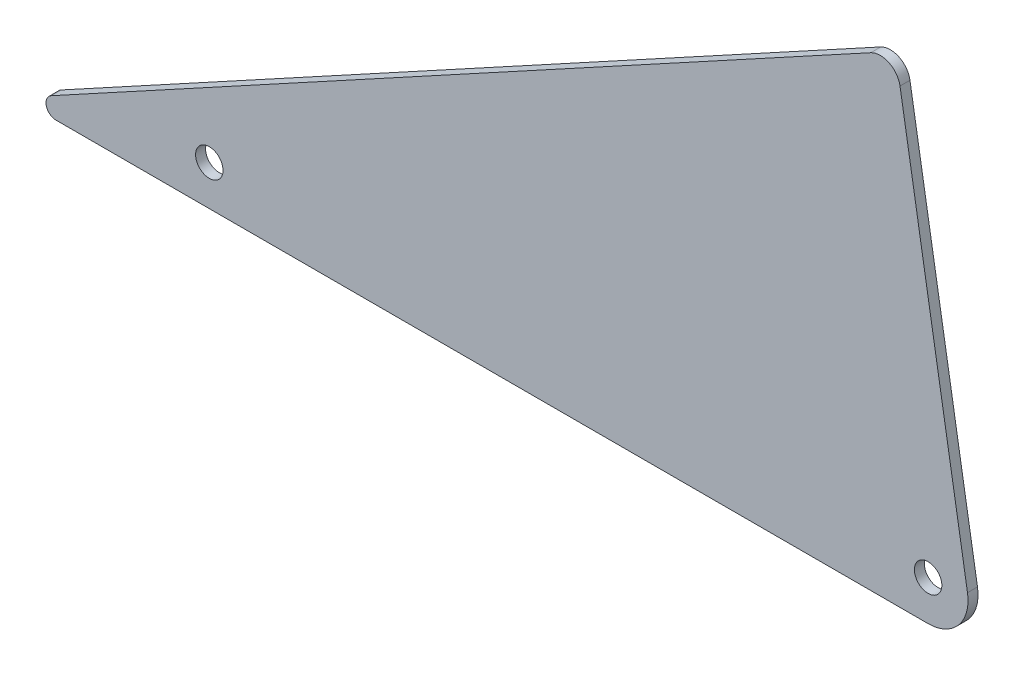
ISO-10303-21;
HEADER;
FILE_DESCRIPTION(('STEP AP214'),'2;1');
FILE_NAME('part.step','',(''),(''),'','','');
FILE_SCHEMA(('AUTOMOTIVE_DESIGN { 1 0 10303 214 1 1 1 1 }'));
ENDSEC;
DATA;
#1=APPLICATION_CONTEXT('core data for automotive mechanical design processes');
#2=APPLICATION_PROTOCOL_DEFINITION('international standard','automotive_design',2000,#1);
#3=PRODUCT_CONTEXT('',#1,'mechanical');
#4=PRODUCT('Part','Part','',(#3));
#5=PRODUCT_RELATED_PRODUCT_CATEGORY('part','',(#4));
#6=PRODUCT_DEFINITION_FORMATION('','',#4);
#7=PRODUCT_DEFINITION_CONTEXT('part definition',#1,'design');
#8=PRODUCT_DEFINITION('design','',#6,#7);
#9=PRODUCT_DEFINITION_SHAPE('','',#8);
#10=(LENGTH_UNIT() NAMED_UNIT(*) SI_UNIT(.MILLI.,.METRE.));
#11=(NAMED_UNIT(*) PLANE_ANGLE_UNIT() SI_UNIT($,.RADIAN.));
#12=(NAMED_UNIT(*) SI_UNIT($,.STERADIAN.) SOLID_ANGLE_UNIT());
#13=UNCERTAINTY_MEASURE_WITH_UNIT(LENGTH_MEASURE(1.E-05),#10,'distance_accuracy_value','');
#14=(GEOMETRIC_REPRESENTATION_CONTEXT(3) GLOBAL_UNCERTAINTY_ASSIGNED_CONTEXT((#13)) GLOBAL_UNIT_ASSIGNED_CONTEXT((#10,
#11,#12)) REPRESENTATION_CONTEXT('',''));
#15=CARTESIAN_POINT('',(0.,0.,0.));
#16=DIRECTION('',(0.,0.,1.));
#17=DIRECTION('',(1.,0.,0.));
#18=AXIS2_PLACEMENT_3D('',#15,#16,#17);
#19=CARTESIAN_POINT('',(0.,0.,0.79375));
#20=DIRECTION('',(0.,0.,-1.));
#21=DIRECTION('',(-1.,0.,0.));
#22=AXIS2_PLACEMENT_3D('',#19,#20,#21);
#23=PLANE('',#22);
#24=DIRECTION('',(-0.877895572914384,-0.478852130680573,0.));
#25=VECTOR('',#24,1.);
#26=CARTESIAN_POINT('',(-152.4,0.,0.79375));
#27=LINE('',#26,#25);
#28=CARTESIAN_POINT('',(-16.618381145427,74.0627011934035,0.79375));
#29=VERTEX_POINT('',#28);
#30=CARTESIAN_POINT('',(-146.93454142633,2.98115922200158,0.79375));
#31=VERTEX_POINT('',#30);
#32=EDGE_CURVE('E145',#29,#31,#27,.T.);
#33=ORIENTED_EDGE('',*,*,#32,.T.);
#34=CARTESIAN_POINT('',(-146.174363668875,1.5875,0.79375));
#35=DIRECTION('',(0.,0.,-1.));
#36=DIRECTION('',(-1.,0.,0.));
#37=AXIS2_PLACEMENT_3D('',#34,#35,#36);
#38=CIRCLE('',#37,1.5875);
#39=CARTESIAN_POINT('',(-146.174363668875,0.,0.79375));
#40=VERTEX_POINT('',#39);
#41=EDGE_CURVE('E11',#31,#40,#38,.F.);
#42=ORIENTED_EDGE('',*,*,#41,.T.);
#43=DIRECTION('',(1.,0.,0.));
#44=VECTOR('',#43,1.);
#45=CARTESIAN_POINT('',(0.,0.,0.79375));
#46=LINE('',#45,#44);
#47=CARTESIAN_POINT('',(-7.49592367789895,0.,0.79375));
#48=VERTEX_POINT('',#47);
#49=EDGE_CURVE('E106',#40,#48,#46,.T.);
#50=ORIENTED_EDGE('',*,*,#49,.T.);
#51=CARTESIAN_POINT('',(-7.49592367789895,6.34999999999999,0.79375));
#52=DIRECTION('',(0.,0.,-1.));
#53=DIRECTION('',(-1.,0.,0.));
#54=AXIS2_PLACEMENT_3D('',#51,#52,#53);
#55=CIRCLE('',#54,6.35);
#56=CARTESIAN_POINT('',(-1.23232226156484,7.39393356938903,0.79375));
#57=VERTEX_POINT('',#56);
#58=EDGE_CURVE('E124',#48,#57,#55,.F.);
#59=ORIENTED_EDGE('',*,*,#58,.T.);
#60=DIRECTION('',(-0.164398987305357,0.986393923832144,0.));
#61=VECTOR('',#60,1.);
#62=CARTESIAN_POINT('',(-12.7,76.2,0.79375));
#63=LINE('',#62,#61);
#64=CARTESIAN_POINT('',(-11.9662249223491,71.7973495340948,0.79375));
#65=VERTEX_POINT('',#64);
#66=EDGE_CURVE('E105',#57,#65,#63,.T.);
#67=ORIENTED_EDGE('',*,*,#66,.T.);
#68=CARTESIAN_POINT('',(-15.0980256305162,71.2753827494003,0.79375));
#69=DIRECTION('',(0.,0.,-1.));
#70=DIRECTION('',(-1.,0.,0.));
#71=AXIS2_PLACEMENT_3D('',#68,#69,#70);
#72=CIRCLE('',#71,3.175);
#73=EDGE_CURVE('E132',#65,#29,#72,.F.);
#74=ORIENTED_EDGE('',*,*,#73,.T.);
#75=EDGE_LOOP('',(#33,#42,#50,#59,#67,#74));
#76=FACE_BOUND('',#75,.T.);
#77=CARTESIAN_POINT('',(-7.49592367789895,6.35,0.79375));
#78=DIRECTION('',(0.,0.,1.));
#79=DIRECTION('',(1.,0.,0.));
#80=AXIS2_PLACEMENT_3D('',#77,#78,#79);
#81=CIRCLE('',#80,2.1828125);
#82=CARTESIAN_POINT('',(-5.31311117789895,6.35,0.79375));
#83=VERTEX_POINT('',#82);
#84=EDGE_CURVE('E112',#83,#83,#81,.T.);
#85=ORIENTED_EDGE('',*,*,#84,.F.);
#86=EDGE_LOOP('',(#85));
#87=FACE_BOUND('',#86,.T.);
#88=CARTESIAN_POINT('',(-121.795923677899,6.34999999999999,0.79375));
#89=DIRECTION('',(0.,0.,1.));
#90=DIRECTION('',(1.,0.,0.));
#91=AXIS2_PLACEMENT_3D('',#88,#89,#90);
#92=CIRCLE('',#91,2.1828125);
#93=CARTESIAN_POINT('',(-119.613111177899,6.34999999999999,0.79375));
#94=VERTEX_POINT('',#93);
#95=EDGE_CURVE('E151',#94,#94,#92,.T.);
#96=ORIENTED_EDGE('',*,*,#95,.F.);
#97=EDGE_LOOP('',(#96));
#98=FACE_BOUND('',#97,.T.);
#99=ADVANCED_FACE('F35',(#76,#87,#98),#23,.F.);
#100=CARTESIAN_POINT('',(0.,0.,-0.79375));
#101=DIRECTION('',(0.,0.,-1.));
#102=DIRECTION('',(-1.,0.,0.));
#103=AXIS2_PLACEMENT_3D('',#100,#101,#102);
#104=PLANE('',#103);
#105=CARTESIAN_POINT('',(-7.49592367789895,6.35,-0.79375));
#106=DIRECTION('',(0.,0.,1.));
#107=DIRECTION('',(1.,0.,0.));
#108=AXIS2_PLACEMENT_3D('',#105,#106,#107);
#109=CIRCLE('',#108,2.1828125);
#110=CARTESIAN_POINT('',(-5.31311117789895,6.35,-0.79375));
#111=VERTEX_POINT('',#110);
#112=EDGE_CURVE('E117',#111,#111,#109,.T.);
#113=ORIENTED_EDGE('',*,*,#112,.T.);
#114=EDGE_LOOP('',(#113));
#115=FACE_BOUND('',#114,.T.);
#116=DIRECTION('',(1.,0.,0.));
#117=VECTOR('',#116,1.);
#118=CARTESIAN_POINT('',(0.,0.,-0.79375));
#119=LINE('',#118,#117);
#120=CARTESIAN_POINT('',(-146.174363668875,0.,-0.79375));
#121=VERTEX_POINT('',#120);
#122=CARTESIAN_POINT('',(-7.49592367789895,0.,-0.79375));
#123=VERTEX_POINT('',#122);
#124=EDGE_CURVE('E114',#121,#123,#119,.T.);
#125=ORIENTED_EDGE('',*,*,#124,.F.);
#126=CARTESIAN_POINT('',(-146.174363668875,1.5875,-0.79375));
#127=DIRECTION('',(0.,0.,-1.));
#128=DIRECTION('',(-1.,0.,0.));
#129=AXIS2_PLACEMENT_3D('',#126,#127,#128);
#130=CIRCLE('',#129,1.5875);
#131=CARTESIAN_POINT('',(-146.93454142633,2.98115922200158,-0.79375));
#132=VERTEX_POINT('',#131);
#133=EDGE_CURVE('E57',#121,#132,#130,.T.);
#134=ORIENTED_EDGE('',*,*,#133,.T.);
#135=DIRECTION('',(-0.877895572914384,-0.478852130680573,0.));
#136=VECTOR('',#135,1.);
#137=CARTESIAN_POINT('',(-152.4,0.,-0.79375));
#138=LINE('',#137,#136);
#139=CARTESIAN_POINT('',(-16.618381145427,74.0627011934035,-0.79375));
#140=VERTEX_POINT('',#139);
#141=EDGE_CURVE('E111',#140,#132,#138,.T.);
#142=ORIENTED_EDGE('',*,*,#141,.F.);
#143=CARTESIAN_POINT('',(-15.0980256305162,71.2753827494003,-0.79375));
#144=DIRECTION('',(0.,0.,-1.));
#145=DIRECTION('',(-1.,0.,0.));
#146=AXIS2_PLACEMENT_3D('',#143,#144,#145);
#147=CIRCLE('',#146,3.175);
#148=CARTESIAN_POINT('',(-11.9662249223491,71.7973495340948,-0.79375));
#149=VERTEX_POINT('',#148);
#150=EDGE_CURVE('E110',#140,#149,#147,.T.);
#151=ORIENTED_EDGE('',*,*,#150,.T.);
#152=DIRECTION('',(-0.164398987305357,0.986393923832144,0.));
#153=VECTOR('',#152,1.);
#154=CARTESIAN_POINT('',(-12.7,76.2,-0.79375));
#155=LINE('',#154,#153);
#156=CARTESIAN_POINT('',(-1.23232226156484,7.39393356938903,-0.79375));
#157=VERTEX_POINT('',#156);
#158=EDGE_CURVE('E102',#157,#149,#155,.T.);
#159=ORIENTED_EDGE('',*,*,#158,.F.);
#160=CARTESIAN_POINT('',(-7.49592367789895,6.34999999999999,-0.79375));
#161=DIRECTION('',(0.,0.,-1.));
#162=DIRECTION('',(-1.,0.,0.));
#163=AXIS2_PLACEMENT_3D('',#160,#161,#162);
#164=CIRCLE('',#163,6.35);
#165=EDGE_CURVE('E89',#157,#123,#164,.T.);
#166=ORIENTED_EDGE('',*,*,#165,.T.);
#167=EDGE_LOOP('',(#125,#134,#142,#151,#159,#166));
#168=FACE_BOUND('',#167,.T.);
#169=CARTESIAN_POINT('',(-121.795923677899,6.34999999999999,-0.79375));
#170=DIRECTION('',(0.,0.,1.));
#171=DIRECTION('',(1.,0.,0.));
#172=AXIS2_PLACEMENT_3D('',#169,#170,#171);
#173=CIRCLE('',#172,2.1828125);
#174=CARTESIAN_POINT('',(-119.613111177899,6.34999999999999,-0.79375));
#175=VERTEX_POINT('',#174);
#176=EDGE_CURVE('E153',#175,#175,#173,.T.);
#177=ORIENTED_EDGE('',*,*,#176,.T.);
#178=EDGE_LOOP('',(#177));
#179=FACE_BOUND('',#178,.T.);
#180=ADVANCED_FACE('F108',(#115,#168,#179),#104,.T.);
#181=CARTESIAN_POINT('',(-12.7,76.2,0.79375));
#182=DIRECTION('',(-0.986393923832144,-0.164398987305357,0.));
#183=DIRECTION('',(0.164398987305357,-0.986393923832144,0.));
#184=AXIS2_PLACEMENT_3D('',#181,#182,#183);
#185=PLANE('',#184);
#186=ORIENTED_EDGE('',*,*,#158,.T.);
#187=DIRECTION('',(0.,0.,-1.));
#188=VECTOR('',#187,1.);
#189=CARTESIAN_POINT('',(-11.9662249223491,71.7973495340948,0.79375));
#190=LINE('',#189,#188);
#191=EDGE_CURVE('E130',#149,#65,#190,.F.);
#192=ORIENTED_EDGE('',*,*,#191,.T.);
#193=ORIENTED_EDGE('',*,*,#66,.F.);
#194=DIRECTION('',(0.,0.,-1.));
#195=VECTOR('',#194,1.);
#196=CARTESIAN_POINT('',(-1.23232226156484,7.39393356938901,0.79375));
#197=LINE('',#196,#195);
#198=EDGE_CURVE('E93',#57,#157,#197,.T.);
#199=ORIENTED_EDGE('',*,*,#198,.T.);
#200=EDGE_LOOP('',(#186,#192,#193,#199));
#201=FACE_BOUND('',#200,.T.);
#202=ADVANCED_FACE('F101',(#201),#185,.F.);
#203=CARTESIAN_POINT('',(-152.4,0.,0.79375));
#204=DIRECTION('',(0.478852130680573,-0.877895572914384,0.));
#205=DIRECTION('',(0.877895572914384,0.478852130680573,0.));
#206=AXIS2_PLACEMENT_3D('',#203,#204,#205);
#207=PLANE('',#206);
#208=ORIENTED_EDGE('',*,*,#141,.T.);
#209=DIRECTION('',(0.,0.,-1.));
#210=VECTOR('',#209,1.);
#211=CARTESIAN_POINT('',(-146.93454142633,2.98115922200158,0.79375));
#212=LINE('',#211,#210);
#213=EDGE_CURVE('E43',#132,#31,#212,.F.);
#214=ORIENTED_EDGE('',*,*,#213,.T.);
#215=ORIENTED_EDGE('',*,*,#32,.F.);
#216=DIRECTION('',(0.,0.,-1.));
#217=VECTOR('',#216,1.);
#218=CARTESIAN_POINT('',(-16.618381145427,74.0627011934035,0.79375));
#219=LINE('',#218,#217);
#220=EDGE_CURVE('E126',#29,#140,#219,.T.);
#221=ORIENTED_EDGE('',*,*,#220,.T.);
#222=EDGE_LOOP('',(#208,#214,#215,#221));
#223=FACE_BOUND('',#222,.T.);
#224=ADVANCED_FACE('F175',(#223),#207,.F.);
#225=CARTESIAN_POINT('',(0.,0.,0.79375));
#226=DIRECTION('',(0.,1.,0.));
#227=DIRECTION('',(0.,0.,1.));
#228=AXIS2_PLACEMENT_3D('',#225,#226,#227);
#229=PLANE('',#228);
#230=ORIENTED_EDGE('',*,*,#49,.F.);
#231=DIRECTION('',(0.,0.,-1.));
#232=VECTOR('',#231,1.);
#233=CARTESIAN_POINT('',(-146.174363668875,0.,0.79375));
#234=LINE('',#233,#232);
#235=EDGE_CURVE('E134',#40,#121,#234,.T.);
#236=ORIENTED_EDGE('',*,*,#235,.T.);
#237=ORIENTED_EDGE('',*,*,#124,.T.);
#238=DIRECTION('',(0.,0.,-1.));
#239=VECTOR('',#238,1.);
#240=CARTESIAN_POINT('',(-7.49592367789895,0.,0.79375));
#241=LINE('',#240,#239);
#242=EDGE_CURVE('E95',#123,#48,#241,.F.);
#243=ORIENTED_EDGE('',*,*,#242,.T.);
#244=EDGE_LOOP('',(#230,#236,#237,#243));
#245=FACE_BOUND('',#244,.T.);
#246=ADVANCED_FACE('F140',(#245),#229,.F.);
#247=CARTESIAN_POINT('',(-7.49592367789895,6.35,0.79375));
#248=DIRECTION('',(0.,0.,-1.));
#249=DIRECTION('',(-1.,0.,0.));
#250=AXIS2_PLACEMENT_3D('',#247,#248,#249);
#251=CYLINDRICAL_SURFACE('',#250,2.1828125);
#252=ORIENTED_EDGE('',*,*,#84,.T.);
#253=EDGE_LOOP('',(#252));
#254=FACE_BOUND('',#253,.T.);
#255=ORIENTED_EDGE('',*,*,#112,.F.);
#256=EDGE_LOOP('',(#255));
#257=FACE_BOUND('',#256,.T.);
#258=ADVANCED_FACE('F170',(#254,#257),#251,.F.);
#259=CARTESIAN_POINT('',(-121.795923677899,6.34999999999999,0.79375));
#260=DIRECTION('',(0.,0.,-1.));
#261=DIRECTION('',(-1.,0.,0.));
#262=AXIS2_PLACEMENT_3D('',#259,#260,#261);
#263=CYLINDRICAL_SURFACE('',#262,2.1828125);
#264=ORIENTED_EDGE('',*,*,#95,.T.);
#265=EDGE_LOOP('',(#264));
#266=FACE_BOUND('',#265,.T.);
#267=ORIENTED_EDGE('',*,*,#176,.F.);
#268=EDGE_LOOP('',(#267));
#269=FACE_BOUND('',#268,.T.);
#270=ADVANCED_FACE('F159',(#266,#269),#263,.F.);
#271=CARTESIAN_POINT('',(-7.49592367789895,6.34999999999999,0.79375));
#272=DIRECTION('',(0.,0.,-1.));
#273=DIRECTION('',(-1.,0.,0.));
#274=AXIS2_PLACEMENT_3D('',#271,#272,#273);
#275=CYLINDRICAL_SURFACE('',#274,6.35);
#276=ORIENTED_EDGE('',*,*,#58,.F.);
#277=ORIENTED_EDGE('',*,*,#242,.F.);
#278=ORIENTED_EDGE('',*,*,#165,.F.);
#279=ORIENTED_EDGE('',*,*,#198,.F.);
#280=EDGE_LOOP('',(#276,#277,#278,#279));
#281=FACE_BOUND('',#280,.T.);
#282=ADVANCED_FACE('F92',(#281),#275,.T.);
#283=CARTESIAN_POINT('',(-15.0980256305162,71.2753827494003,0.79375));
#284=DIRECTION('',(0.,0.,-1.));
#285=DIRECTION('',(-1.,0.,0.));
#286=AXIS2_PLACEMENT_3D('',#283,#284,#285);
#287=CYLINDRICAL_SURFACE('',#286,3.175);
#288=ORIENTED_EDGE('',*,*,#73,.F.);
#289=ORIENTED_EDGE('',*,*,#191,.F.);
#290=ORIENTED_EDGE('',*,*,#150,.F.);
#291=ORIENTED_EDGE('',*,*,#220,.F.);
#292=EDGE_LOOP('',(#288,#289,#290,#291));
#293=FACE_BOUND('',#292,.T.);
#294=ADVANCED_FACE('F181',(#293),#287,.T.);
#295=CARTESIAN_POINT('',(-146.174363668875,1.5875,0.79375));
#296=DIRECTION('',(0.,0.,-1.));
#297=DIRECTION('',(-1.,0.,0.));
#298=AXIS2_PLACEMENT_3D('',#295,#296,#297);
#299=CYLINDRICAL_SURFACE('',#298,1.5875);
#300=ORIENTED_EDGE('',*,*,#41,.F.);
#301=ORIENTED_EDGE('',*,*,#213,.F.);
#302=ORIENTED_EDGE('',*,*,#133,.F.);
#303=ORIENTED_EDGE('',*,*,#235,.F.);
#304=EDGE_LOOP('',(#300,#301,#302,#303));
#305=FACE_BOUND('',#304,.T.);
#306=ADVANCED_FACE('F37',(#305),#299,.T.);
#307=CLOSED_SHELL('',(#99,#180,#202,#224,#246,#258,#270,#282,#294,#306));
#308=MANIFOLD_SOLID_BREP('B2',#307);
#309=ADVANCED_BREP_SHAPE_REPRESENTATION('',(#18,#308),#14);
#310=SHAPE_DEFINITION_REPRESENTATION(#9,#309);
ENDSEC;
END-ISO-10303-21;
